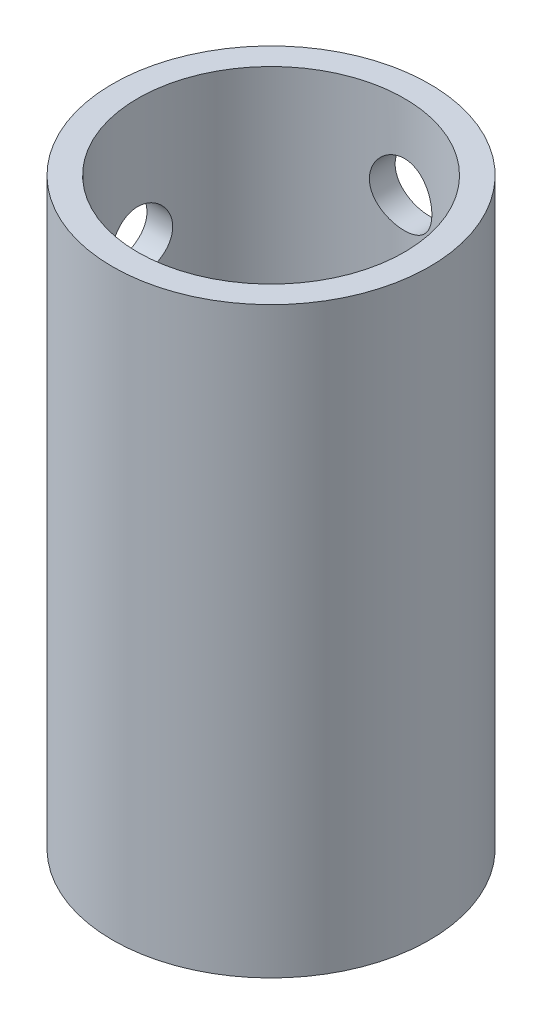
ISO-10303-21;
HEADER;
FILE_DESCRIPTION(('STEP AP214'),'2;1');
FILE_NAME('part.step','',(''),(''),'','','');
FILE_SCHEMA(('AUTOMOTIVE_DESIGN { 1 0 10303 214 1 1 1 1 }'));
ENDSEC;
DATA;
#1=APPLICATION_CONTEXT('core data for automotive mechanical design processes');
#2=APPLICATION_PROTOCOL_DEFINITION('international standard','automotive_design',2000,#1);
#3=PRODUCT_CONTEXT('',#1,'mechanical');
#4=PRODUCT('Part','Part','',(#3));
#5=PRODUCT_RELATED_PRODUCT_CATEGORY('part','',(#4));
#6=PRODUCT_DEFINITION_FORMATION('','',#4);
#7=PRODUCT_DEFINITION_CONTEXT('part definition',#1,'design');
#8=PRODUCT_DEFINITION('design','',#6,#7);
#9=PRODUCT_DEFINITION_SHAPE('','',#8);
#10=(LENGTH_UNIT() NAMED_UNIT(*) SI_UNIT(.MILLI.,.METRE.));
#11=(NAMED_UNIT(*) PLANE_ANGLE_UNIT() SI_UNIT($,.RADIAN.));
#12=(NAMED_UNIT(*) SI_UNIT($,.STERADIAN.) SOLID_ANGLE_UNIT());
#13=UNCERTAINTY_MEASURE_WITH_UNIT(LENGTH_MEASURE(1.E-05),#10,'distance_accuracy_value','');
#14=(GEOMETRIC_REPRESENTATION_CONTEXT(3) GLOBAL_UNCERTAINTY_ASSIGNED_CONTEXT((#13)) GLOBAL_UNIT_ASSIGNED_CONTEXT((#10,
#11,#12)) REPRESENTATION_CONTEXT('',''));
#15=CARTESIAN_POINT('',(0.,0.,0.));
#16=DIRECTION('',(0.,0.,1.));
#17=DIRECTION('',(1.,0.,0.));
#18=AXIS2_PLACEMENT_3D('',#15,#16,#17);
#19=CARTESIAN_POINT('',(0.,88.9,0.));
#20=DIRECTION('',(0.,1.,0.));
#21=DIRECTION('',(0.,0.,1.));
#22=AXIS2_PLACEMENT_3D('',#19,#20,#21);
#23=PLANE('',#22);
#24=CARTESIAN_POINT('',(0.,88.9,0.));
#25=DIRECTION('',(0.,1.,0.));
#26=DIRECTION('',(0.,0.,1.));
#27=AXIS2_PLACEMENT_3D('',#24,#25,#26);
#28=CIRCLE('',#27,24.1554);
#29=CARTESIAN_POINT('',(0.,88.9,24.1554));
#30=VERTEX_POINT('',#29);
#31=EDGE_CURVE('E10',#30,#30,#28,.T.);
#32=ORIENTED_EDGE('',*,*,#31,.T.);
#33=EDGE_LOOP('',(#32));
#34=FACE_BOUND('',#33,.T.);
#35=CARTESIAN_POINT('',(0.,88.9,0.));
#36=DIRECTION('',(0.,1.,0.));
#37=DIRECTION('',(0.,0.,1.));
#38=AXIS2_PLACEMENT_3D('',#35,#36,#37);
#39=CIRCLE('',#38,20.32);
#40=CARTESIAN_POINT('',(0.,88.9,20.32));
#41=VERTEX_POINT('',#40);
#42=EDGE_CURVE('E50',#41,#41,#39,.T.);
#43=ORIENTED_EDGE('',*,*,#42,.F.);
#44=EDGE_LOOP('',(#43));
#45=FACE_BOUND('',#44,.T.);
#46=ADVANCED_FACE('F31',(#34,#45),#23,.T.);
#47=CARTESIAN_POINT('',(0.,0.,0.));
#48=DIRECTION('',(0.,1.,0.));
#49=DIRECTION('',(0.,0.,1.));
#50=AXIS2_PLACEMENT_3D('',#47,#48,#49);
#51=PLANE('',#50);
#52=CARTESIAN_POINT('',(0.,0.,0.));
#53=DIRECTION('',(0.,1.,0.));
#54=DIRECTION('',(0.,0.,1.));
#55=AXIS2_PLACEMENT_3D('',#52,#53,#54);
#56=CIRCLE('',#55,24.1554);
#57=CARTESIAN_POINT('',(0.,0.,24.1554));
#58=VERTEX_POINT('',#57);
#59=EDGE_CURVE('E45',#58,#58,#56,.T.);
#60=ORIENTED_EDGE('',*,*,#59,.F.);
#61=EDGE_LOOP('',(#60));
#62=FACE_BOUND('',#61,.T.);
#63=CARTESIAN_POINT('',(0.,0.,0.));
#64=DIRECTION('',(0.,1.,0.));
#65=DIRECTION('',(0.,0.,1.));
#66=AXIS2_PLACEMENT_3D('',#63,#64,#65);
#67=CIRCLE('',#66,20.32);
#68=CARTESIAN_POINT('',(0.,0.,20.32));
#69=VERTEX_POINT('',#68);
#70=EDGE_CURVE('E53',#69,#69,#67,.T.);
#71=ORIENTED_EDGE('',*,*,#70,.T.);
#72=EDGE_LOOP('',(#71));
#73=FACE_BOUND('',#72,.T.);
#74=ADVANCED_FACE('F88',(#62,#73),#51,.F.);
#75=CARTESIAN_POINT('',(0.,88.9,0.));
#76=DIRECTION('',(0.,-1.,0.));
#77=DIRECTION('',(0.,0.,-1.));
#78=AXIS2_PLACEMENT_3D('',#75,#76,#77);
#79=CYLINDRICAL_SURFACE('',#78,24.1554);
#80=CARTESIAN_POINT('',(-23.6812572071248,69.85,-4.7625));
#81=CARTESIAN_POINT('',(-23.6812624432822,70.1147071627906,-4.7624901250679));
#82=CARTESIAN_POINT('',(-23.685743761445,70.379539558118,-4.74035580950144));
#83=CARTESIAN_POINT('',(-23.7031594442269,70.9017180638512,-4.65247387491668));
#84=CARTESIAN_POINT('',(-23.716100667004,71.1590579233658,-4.586690870736));
#85=CARTESIAN_POINT('',(-23.7489148036137,71.6586210164292,-4.41362596366756));
#86=CARTESIAN_POINT('',(-23.7687809230381,71.9008587938542,-4.30638472659384));
#87=CARTESIAN_POINT('',(-23.813198371139,72.363895513952,-4.05355804277837));
#88=CARTESIAN_POINT('',(-23.8377494142076,72.5846957622869,-3.90797493327272));
#89=CARTESIAN_POINT('',(-23.8891474457192,73.0016375950946,-3.58046382448883));
#90=CARTESIAN_POINT('',(-23.9160190079756,73.1974416187426,-3.39810987835323));
#91=CARTESIAN_POINT('',(-23.9688138709097,73.5558872533006,-3.00315381123502));
#92=CARTESIAN_POINT('',(-23.9947371060134,73.7185265745197,-2.79054960349371));
#93=CARTESIAN_POINT('',(-24.0429790900059,74.0073321507319,-2.33889691649043));
#94=CARTESIAN_POINT('',(-24.0652654899036,74.1331782064268,-2.09963993697773));
#95=CARTESIAN_POINT('',(-24.1034469108701,74.3427595030653,-1.60286493436308));
#96=CARTESIAN_POINT('',(-24.1193425131908,74.4264985738712,-1.3453485744843));
#97=CARTESIAN_POINT('',(-24.1427777365083,74.5484396601457,-0.82286675970404));
#98=CARTESIAN_POINT('',(-24.1504218269628,74.5872114700761,-0.5580390518447));
#99=CARTESIAN_POINT('',(-24.1568533822301,74.6198946349946,-0.0255348590097673));
#100=CARTESIAN_POINT('',(-24.1556416774119,74.613810195955,0.242141356523677));
#101=CARTESIAN_POINT('',(-24.1445792795746,74.5573868679244,0.768830664213412));
#102=CARTESIAN_POINT('',(-24.1348483935526,74.5076616838684,1.02791238342972));
#103=CARTESIAN_POINT('',(-24.1079759403617,74.366341153616,1.53398084981905));
#104=CARTESIAN_POINT('',(-24.0908340826555,74.2747441658844,1.78096712238384));
#105=CARTESIAN_POINT('',(-24.050867651333,74.0517078275796,2.25759124510069));
#106=CARTESIAN_POINT('',(-24.0280087767227,73.920026906381,2.48711305843599));
#107=CARTESIAN_POINT('',(-23.9791301200994,73.6207392161528,2.92103002541779));
#108=CARTESIAN_POINT('',(-23.9531099842908,73.4531284243889,3.12542236151445));
#109=CARTESIAN_POINT('',(-23.90026456997,73.083368589885,3.50691909643202));
#110=CARTESIAN_POINT('',(-23.8734331193731,72.8806824916468,3.68350249466342));
#111=CARTESIAN_POINT('',(-23.822408068296,72.4483045323699,4.00025505509381));
#112=CARTESIAN_POINT('',(-23.7982145149447,72.2186121889874,4.14042356676284));
#113=CARTESIAN_POINT('',(-23.7551931300784,71.7380069976139,4.38053989691627));
#114=CARTESIAN_POINT('',(-23.7363763049166,71.4870519656708,4.48040538347757));
#115=CARTESIAN_POINT('',(-23.7064019240234,70.9714683426218,4.63640275940167));
#116=CARTESIAN_POINT('',(-23.6952434006637,70.7068414834991,4.69254017393696));
#117=CARTESIAN_POINT('',(-23.6820423235531,70.176142468483,4.75871338927884));
#118=CARTESIAN_POINT('',(-23.6798511923951,69.9101676082023,4.76950066250853));
#119=CARTESIAN_POINT('',(-23.6844344583095,69.3802184738129,4.7466877256515));
#120=CARTESIAN_POINT('',(-23.6912083622169,69.1162440904617,4.71308995717796));
#121=CARTESIAN_POINT('',(-23.7128194816892,68.6003021706195,4.60310787451524));
#122=CARTESIAN_POINT('',(-23.7275813226517,68.3482459751415,4.52712332049563));
#123=CARTESIAN_POINT('',(-23.7634392043961,67.8604420959814,4.33495126831185));
#124=CARTESIAN_POINT('',(-23.7845357543538,67.6246957251367,4.2187605383129));
#125=CARTESIAN_POINT('',(-23.8310208544897,67.1729100252135,3.94776667286771));
#126=CARTESIAN_POINT('',(-23.8564604706919,66.9571587274486,3.79249227733631));
#127=CARTESIAN_POINT('',(-23.9086243722687,66.5545007515152,3.44836862440196));
#128=CARTESIAN_POINT('',(-23.9353487857656,66.3675969579268,3.25951601343347));
#129=CARTESIAN_POINT('',(-23.987552219003,66.0251000217249,2.85022725050358));
#130=CARTESIAN_POINT('',(-24.0130067797525,65.8700143520065,2.62936281832281));
#131=CARTESIAN_POINT('',(-24.059380365509,65.599151293086,2.16427784644934));
#132=CARTESIAN_POINT('',(-24.0802995774624,65.4833722835576,1.92005827005059));
#133=CARTESIAN_POINT('',(-24.1151408253291,65.2951534155386,1.41654534745723));
#134=CARTESIAN_POINT('',(-24.1291017186042,65.222472442063,1.1573449407141));
#135=CARTESIAN_POINT('',(-24.1486197697839,65.1217475019746,0.630112624889908));
#136=CARTESIAN_POINT('',(-24.1541779099738,65.0936983178667,0.362081751837708));
#137=CARTESIAN_POINT('',(-24.1562418355085,65.0832305002557,-0.170351375162292));
#138=CARTESIAN_POINT('',(-24.1528991418724,65.1000480981373,-0.434738324648256));
#139=CARTESIAN_POINT('',(-24.1378546988503,65.177153227216,-0.956839965327164));
#140=CARTESIAN_POINT('',(-24.1261530485502,65.2374402431317,-1.21455473557383));
#141=CARTESIAN_POINT('',(-24.0957087713493,65.3994374489598,-1.71553729433952));
#142=CARTESIAN_POINT('',(-24.0769813383013,65.5010582906004,-1.9588349557095));
#143=CARTESIAN_POINT('',(-24.0345044592979,65.7427431554663,-2.42503673706688));
#144=CARTESIAN_POINT('',(-24.0107546302759,65.8828101112839,-2.64793929962707));
#145=CARTESIAN_POINT('',(-23.9603757703728,66.1999998399749,-3.07080686849756));
#146=CARTESIAN_POINT('',(-23.933707362322,66.3776702895912,-3.27035642179728));
#147=CARTESIAN_POINT('',(-23.8807342707579,66.7638956745041,-3.63707204322628));
#148=CARTESIAN_POINT('',(-23.8544296747153,66.9724579006221,-3.80423044510831));
#149=CARTESIAN_POINT('',(-23.8048614498442,67.4171501267863,-4.10306808358924));
#150=CARTESIAN_POINT('',(-23.7816323347244,67.6535445489749,-4.23435979512627));
#151=CARTESIAN_POINT('',(-23.7412652004059,68.1454275236267,-4.4551514859022));
#152=CARTESIAN_POINT('',(-23.7241216068256,68.4008983409358,-4.54468973532421));
#153=CARTESIAN_POINT('',(-23.7013242902654,68.8558242344841,-4.66187558902265));
#154=CARTESIAN_POINT('',(-23.693845316479,69.0526681315923,-4.69954289284168));
#155=CARTESIAN_POINT('',(-23.6838098751832,69.4496508775573,-4.74985842387384));
#156=CARTESIAN_POINT('',(-23.6812532467746,69.6497896184981,-4.76250746887202));
#157=CARTESIAN_POINT('',(-23.6812572071248,69.85,-4.7625));
#158=B_SPLINE_CURVE_WITH_KNOTS('',3,(#80,#81,#82,#83,#84,#85,#86,#87,#88,#89,#90,#91,#92,#93,
#94,#95,#96,#97,#98,#99,#100,#101,#102,#103,#104,#105,#106,#107,#108,#109,#110,#111,#112,#113,
#114,#115,#116,#117,#118,#119,#120,#121,#122,#123,#124,#125,#126,#127,#128,#129,#130,#131,#132,
#133,#134,#135,#136,#137,#138,#139,#140,#141,#142,#143,#144,#145,#146,#147,#148,#149,#150,#151,
#152,#153,#154,#155,#156,#157),.UNSPECIFIED.,.T.,.F.,(4,2,2,2,2,2,2,2,2,2,2,2,2,2,2,2,2,2,2,2,2,
2,2,2,2,2,2,2,2,2,2,2,2,2,2,2,2,2,4),(0.,0.793388516325587,1.58742100475954,2.38067660570947,
3.1738838627329,3.97687008676941,4.77991173021484,5.58974704048092,6.39950867843342,
7.19889342475629,7.99820321725651,8.78644952041961,9.5747267285114,10.3678519334846,
11.1610659837534,11.9677191613308,12.7743867482896,13.5826939725545,14.3908990482137,
15.1856576846343,15.9803726033453,16.767716089197,17.5551228776464,18.3525214069971,
19.1499996199112,19.9593483576205,20.768663727745,21.5734075301297,22.3780572503518,
23.1690971632356,23.9601276993785,24.7494573344406,25.53884719472,26.3406407618669,
27.1426238641142,27.9529570990115,28.7625461356595,29.3626425151898,29.962719278728),.UNSPECIFIED.);
#159=CARTESIAN_POINT('',(-23.6812572071248,69.85,-4.7625));
#160=VERTEX_POINT('',#159);
#161=EDGE_CURVE('E62',#160,#160,#158,.T.);
#162=ORIENTED_EDGE('',*,*,#161,.T.);
#163=EDGE_LOOP('',(#162));
#164=FACE_BOUND('',#163,.T.);
#165=CARTESIAN_POINT('',(0.,80.9625,-24.1554));
#166=CARTESIAN_POINT('',(-0.264763542173837,80.9624901687644,-24.1553951347501));
#167=CARTESIAN_POINT('',(-0.52965219881599,80.940346742801,-24.1510022129458));
#168=CARTESIAN_POINT('',(-1.05194752569415,80.852425343044,-24.1339016309654));
#169=CARTESIAN_POINT('',(-1.30934799103893,80.7866122013515,-24.1211872695177));
#170=CARTESIAN_POINT('',(-1.80903943353851,80.6134591848702,-24.0888641359616));
#171=CARTESIAN_POINT('',(-2.05134444102881,80.5061585595912,-24.0692618817838));
#172=CARTESIAN_POINT('',(-2.5144944909007,80.2531918843976,-24.0252961417605));
#173=CARTESIAN_POINT('',(-2.73534091613329,80.1075283089463,-24.0009329630274));
#174=CARTESIAN_POINT('',(-3.1522334468627,79.7799347259105,-23.9497695589749));
#175=CARTESIAN_POINT('',(-3.34795595993617,79.597596840065,-23.9229439565521));
#176=CARTESIAN_POINT('',(-3.7062434667598,79.20270748469,-23.870064602647));
#177=CARTESIAN_POINT('',(-3.86880592047441,78.9901537027601,-23.8440109104231));
#178=CARTESIAN_POINT('',(-4.15752880267533,78.5385480065779,-23.7953777356228));
#179=CARTESIAN_POINT('',(-4.28335553447681,78.2992789227312,-23.7728309208219));
#180=CARTESIAN_POINT('',(-4.4928978031172,77.8024777356457,-23.7341240867229));
#181=CARTESIAN_POINT('',(-4.57661737624298,77.5449473855874,-23.7179634552929));
#182=CARTESIAN_POINT('',(-4.69852110455442,77.0224111546494,-23.69411520027));
#183=CARTESIAN_POINT('',(-4.73727221880451,76.7575424490249,-23.686322174398));
#184=CARTESIAN_POINT('',(-4.76989977129345,76.2249571247673,-23.6797741117301));
#185=CARTESIAN_POINT('',(-4.76378066614101,75.9572407916042,-23.6810181773504));
#186=CARTESIAN_POINT('',(-4.70730018195985,75.4306982529004,-23.6923079195356));
#187=CARTESIAN_POINT('',(-4.65758751970927,75.1717992825771,-23.7022245338856));
#188=CARTESIAN_POINT('',(-4.51635451080862,74.6660897476093,-23.7295389203918));
#189=CARTESIAN_POINT('',(-4.42483221846068,74.419279746142,-23.7469370407133));
#190=CARTESIAN_POINT('',(-4.20195502368091,73.942878015266,-23.7873867495646));
#191=CARTESIAN_POINT('',(-4.07034187677795,73.7134103255514,-23.8104747998733));
#192=CARTESIAN_POINT('',(-3.77120129689521,73.2795733383295,-23.8596793567626));
#193=CARTESIAN_POINT('',(-3.6036698482519,73.0752068511565,-23.8857962018122));
#194=CARTESIAN_POINT('',(-3.23396930630152,72.6936291004594,-23.9386755160817));
#195=CARTESIAN_POINT('',(-3.03124626064001,72.5169545679815,-23.9654412938101));
#196=CARTESIAN_POINT('',(-2.59876090172113,72.200035321926,-24.016184522859));
#197=CARTESIAN_POINT('',(-2.36899826021206,72.059791050666,-24.0401619403228));
#198=CARTESIAN_POINT('',(-1.88836807713478,71.8196187706016,-24.0826832417972));
#199=CARTESIAN_POINT('',(-1.63746975678765,71.7197508303868,-24.1012190190453));
#200=CARTESIAN_POINT('',(-1.12201024451363,71.5637314612385,-24.1307067852562));
#201=CARTESIAN_POINT('',(-0.857450664074372,71.5075748885994,-24.1416596665143));
#202=CARTESIAN_POINT('',(-0.326792081401532,71.441329239632,-24.1546236768324));
#203=CARTESIAN_POINT('',(-0.0607881749667143,71.4305054360856,-24.1567774032744));
#204=CARTESIAN_POINT('',(0.469227580389069,71.4532556927609,-24.1522960083829));
#205=CARTESIAN_POINT('',(0.733239537205333,71.4868273306567,-24.1456613665648));
#206=CARTESIAN_POINT('',(1.24941604115357,71.5968049782274,-24.1244378427394));
#207=CARTESIAN_POINT('',(1.50166377406096,71.6728352106581,-24.1099187720699));
#208=CARTESIAN_POINT('',(1.98983071051704,71.865162122553,-24.0745482575083));
#209=CARTESIAN_POINT('',(2.22574871513438,71.9814617548486,-24.0536963492624));
#210=CARTESIAN_POINT('',(2.67766658386679,72.2526241362356,-24.0076178627108));
#211=CARTESIAN_POINT('',(2.89339497970789,72.4079307661525,-23.982342021693));
#212=CARTESIAN_POINT('',(3.2959919345318,72.7521027540416,-23.9303377854538));
#213=CARTESIAN_POINT('',(3.48285748889903,72.9409716014382,-23.9036092393971));
#214=CARTESIAN_POINT('',(3.82524984108531,73.3502472415945,-23.8512331593297));
#215=CARTESIAN_POINT('',(3.98027292433527,73.5710787009541,-23.8256074266273));
#216=CARTESIAN_POINT('',(4.25102629515299,74.036078910645,-23.7787947842749));
#217=CARTESIAN_POINT('',(4.36675813095151,74.280246740945,-23.7576076997371));
#218=CARTESIAN_POINT('',(4.55494991770783,74.7837747629212,-23.7222461514111));
#219=CARTESIAN_POINT('',(4.62763080972161,75.043049749496,-23.7080359472077));
#220=CARTESIAN_POINT('',(4.72833040035522,75.5704411292129,-23.6881599598845));
#221=CARTESIAN_POINT('',(4.75635473847747,75.8385564015841,-23.6824930978641));
#222=CARTESIAN_POINT('',(4.76674161379691,76.3709629751712,-23.6804041207086));
#223=CARTESIAN_POINT('',(4.74989976929061,76.6352384449807,-23.6838209215046));
#224=CARTESIAN_POINT('',(4.67278503905074,77.1571106501505,-23.6991550067161));
#225=CARTESIAN_POINT('',(4.61251248058547,77.4147074358224,-23.7110722270773));
#226=CARTESIAN_POINT('',(4.45059774045942,77.9154219859655,-23.7419933226827));
#227=CARTESIAN_POINT('',(4.34905047727914,78.1585715137271,-23.7609809299754));
#228=CARTESIAN_POINT('',(4.10755916671771,78.6245071225177,-23.8039131626329));
#229=CARTESIAN_POINT('',(3.96761201601998,78.847291555785,-23.827858188597));
#230=CARTESIAN_POINT('',(3.65056478268792,79.2701402085515,-23.8785018010624));
#231=CARTESIAN_POINT('',(3.47288907850723,79.4697682454092,-23.9052393444416));
#232=CARTESIAN_POINT('',(3.086619536146,79.836639774433,-23.9581730217806));
#233=CARTESIAN_POINT('',(2.8780186043848,80.0038758162201,-23.9843690299491));
#234=CARTESIAN_POINT('',(2.43328506128356,80.3028103328005,-24.0335802606447));
#235=CARTESIAN_POINT('',(2.19689521589035,80.434132078116,-24.0565606144032));
#236=CARTESIAN_POINT('',(1.70501928374088,80.6549811349237,-24.0964087679017));
#237=CARTESIAN_POINT('',(1.44955082549667,80.7445464880255,-24.1132821281896));
#238=CARTESIAN_POINT('',(0.9945553308215,80.861798230949,-24.1356993063735));
#239=CARTESIAN_POINT('',(0.797635219871518,80.8994947207419,-24.1430441857016));
#240=CARTESIAN_POINT('',(0.400500538179269,80.9498489445849,-24.152896299461));
#241=CARTESIAN_POINT('',(0.200286067410158,80.9625074370493,-24.1554036804228));
#242=CARTESIAN_POINT('',(0.,80.9625,-24.1554));
#243=B_SPLINE_CURVE_WITH_KNOTS('',3,(#165,#166,#167,#168,#169,#170,#171,#172,#173,#174,#175,
#176,#177,#178,#179,#180,#181,#182,#183,#184,#185,#186,#187,#188,#189,#190,#191,#192,#193,#194,
#195,#196,#197,#198,#199,#200,#201,#202,#203,#204,#205,#206,#207,#208,#209,#210,#211,#212,#213,
#214,#215,#216,#217,#218,#219,#220,#221,#222,#223,#224,#225,#226,#227,#228,#229,#230,#231,#232,
#233,#234,#235,#236,#237,#238,#239,#240,#241,#242),.UNSPECIFIED.,.T.,.F.,(4,2,2,2,2,2,2,2,2,2,2,
2,2,2,2,2,2,2,2,2,2,2,2,2,2,2,2,2,2,2,2,2,2,2,2,2,2,2,4),(0.,0.793557978124505,1.58775579765687,
2.38120409227143,3.17460122090118,3.97736566951724,4.78019158621282,5.59009811467836,
6.399926992727,7.19943069907904,7.9988549980434,8.78658115328042,9.57434397072324,
10.3672924798558,11.1603296868453,11.9672202468803,12.7741206033095,13.5822170211481,
14.3902183324052,15.185072103078,15.9798825063353,16.7677674935933,17.5557102662734,
18.3530614566904,19.1504955953335,19.9597094776735,20.76889147008,21.5738838604384,
22.3787745833816,23.1694874932378,23.9601944448096,24.7490932222765,25.538055773995,
26.3400531547543,27.142234781876,27.9525337022581,28.7620929609552,29.3624151199287,
29.9627190945453),.UNSPECIFIED.);
#244=CARTESIAN_POINT('',(0.,80.9625,-24.1554));
#245=VERTEX_POINT('',#244);
#246=EDGE_CURVE('E61',#245,#245,#243,.T.);
#247=ORIENTED_EDGE('',*,*,#246,.T.);
#248=EDGE_LOOP('',(#247));
#249=FACE_BOUND('',#248,.T.);
#250=ORIENTED_EDGE('',*,*,#31,.F.);
#251=EDGE_LOOP('',(#250));
#252=FACE_BOUND('',#251,.T.);
#253=ORIENTED_EDGE('',*,*,#59,.T.);
#254=EDGE_LOOP('',(#253));
#255=FACE_BOUND('',#254,.T.);
#256=ADVANCED_FACE('F33',(#164,#249,#252,#255),#79,.T.);
#257=CARTESIAN_POINT('',(0.,88.9,0.));
#258=DIRECTION('',(0.,-1.,0.));
#259=DIRECTION('',(0.,0.,-1.));
#260=AXIS2_PLACEMENT_3D('',#257,#258,#259);
#261=CYLINDRICAL_SURFACE('',#260,20.32);
#262=CARTESIAN_POINT('',(-19.7540120924839,69.85,-4.7625));
#263=CARTESIAN_POINT('',(-19.7540173514219,70.1135391583576,-4.76249164713757));
#264=CARTESIAN_POINT('',(-19.7593434432666,70.3771746995928,-4.74055060994133));
#265=CARTESIAN_POINT('',(-19.7800258826579,70.8969129368943,-4.65348330600756));
#266=CARTESIAN_POINT('',(-19.7953887917612,71.1530105905376,-4.58832878808747));
#267=CARTESIAN_POINT('',(-19.8343115230671,71.6500801282435,-4.41702812308156));
#268=CARTESIAN_POINT('',(-19.8578615827076,71.8910696254746,-4.31093078073417));
#269=CARTESIAN_POINT('',(-19.9104931892119,72.3518442254637,-4.06090048509455));
#270=CARTESIAN_POINT('',(-19.9395747933912,72.5716291084731,-3.91696713975595));
#271=CARTESIAN_POINT('',(-20.0006225730661,72.9880130016659,-3.59237637042963));
#272=CARTESIAN_POINT('',(-20.0326301878775,73.1841411701884,-3.4111226349007));
#273=CARTESIAN_POINT('',(-20.095562387331,73.5435088171937,-3.01832218220031));
#274=CARTESIAN_POINT('',(-20.126486879614,73.7067454965909,-2.80677288947715));
#275=CARTESIAN_POINT('',(-20.184223338583,73.997590067381,-2.35619595188712));
#276=CARTESIAN_POINT('',(-20.2109806985805,74.1247403663517,-2.1168653331023));
#277=CARTESIAN_POINT('',(-20.2568977033374,74.3368352521855,-1.61949890063755));
#278=CARTESIAN_POINT('',(-20.2760583297624,74.421785292612,-1.36146550886888));
#279=CARTESIAN_POINT('',(-20.3043300933233,74.5455740885188,-0.83892051199974));
#280=CARTESIAN_POINT('',(-20.3136149927318,74.5852110892385,-0.574607569699432));
#281=CARTESIAN_POINT('',(-20.3216928738208,74.6197492159841,-0.0429315797710147));
#282=CARTESIAN_POINT('',(-20.3204872259362,74.6146561853259,0.224431064901445));
#283=CARTESIAN_POINT('',(-20.3078509856042,74.5604634654217,0.749098019815182));
#284=CARTESIAN_POINT('',(-20.2966204496921,74.5122247535571,1.00649679521888));
#285=CARTESIAN_POINT('',(-20.2654266091964,74.3744877485673,1.50944008882897));
#286=CARTESIAN_POINT('',(-20.2454628736018,74.2849874190399,1.75498402129736));
#287=CARTESIAN_POINT('',(-20.1987316039252,74.0665379895639,2.22957841171315));
#288=CARTESIAN_POINT('',(-20.1719097638709,73.9372722652212,2.45847756514933));
#289=CARTESIAN_POINT('',(-20.1143882630683,73.643199401287,2.89164311763799));
#290=CARTESIAN_POINT('',(-20.0836880023379,73.4783867598789,3.0959056958957));
#291=CARTESIAN_POINT('',(-20.0209071432427,73.1132452198691,3.47912830128302));
#292=CARTESIAN_POINT('',(-19.9888110863201,72.9121631739547,3.65736888412752));
#293=CARTESIAN_POINT('',(-19.9275341011303,72.4826272604266,3.97774649866238));
#294=CARTESIAN_POINT('',(-19.8983532775076,72.2541724108934,4.11988223462571));
#295=CARTESIAN_POINT('',(-19.8461622896702,71.7750934369047,4.36440224547437));
#296=CARTESIAN_POINT('',(-19.8231761138401,71.5243879894004,4.46663265541371));
#297=CARTESIAN_POINT('',(-19.7862959741439,71.0086852760441,4.62728404113041));
#298=CARTESIAN_POINT('',(-19.7724003281834,70.7436906640607,4.68571312211488));
#299=CARTESIAN_POINT('',(-19.7556226234519,70.2135534569267,4.75594995605509));
#300=CARTESIAN_POINT('',(-19.7524912939381,69.9485584114714,4.7688131037547));
#301=CARTESIAN_POINT('',(-19.7569213762032,69.4202097346848,4.75042586061012));
#302=CARTESIAN_POINT('',(-19.7644819343552,69.1568559740014,4.7191789914544));
#303=CARTESIAN_POINT('',(-19.7892068027707,68.6430575611209,4.6143792503335));
#304=CARTESIAN_POINT('',(-19.8062354444263,68.3924839488253,4.54142361750285));
#305=CARTESIAN_POINT('',(-19.8478522842961,67.9071192320565,4.35593140950215));
#306=CARTESIAN_POINT('',(-19.8724412918113,67.6723298204873,4.24339059674171));
#307=CARTESIAN_POINT('',(-19.9269448662728,67.2206772442817,3.97965412663702));
#308=CARTESIAN_POINT('',(-19.9569449558736,67.0041988489719,3.8278175966443));
#309=CARTESIAN_POINT('',(-20.0186726748586,66.5994063177104,3.49062452184264));
#310=CARTESIAN_POINT('',(-20.0504005517986,66.4110962322464,3.30526316475027));
#311=CARTESIAN_POINT('',(-20.1128418541569,66.0638029505823,2.90147310563081));
#312=CARTESIAN_POINT('',(-20.1435183473688,65.9055444804249,2.68241435445607));
#313=CARTESIAN_POINT('',(-20.1996825103016,65.6280682878547,2.22021193999274));
#314=CARTESIAN_POINT('',(-20.2251704389178,65.5088486173315,1.97706947931603));
#315=CARTESIAN_POINT('',(-20.2679319678358,65.3138000148804,1.47521402110231));
#316=CARTESIAN_POINT('',(-20.2852613768816,65.2376755398509,1.21662086335579));
#317=CARTESIAN_POINT('',(-20.3099961749922,65.1300706765654,0.689858700652902));
#318=CARTESIAN_POINT('',(-20.3174032336036,65.0985827776529,0.421691314465783));
#319=CARTESIAN_POINT('',(-20.3214001470995,65.0815240527821,-0.109762785763345));
#320=CARTESIAN_POINT('',(-20.3182434348765,65.094877476291,-0.373013624054597));
#321=CARTESIAN_POINT('',(-20.3020196892177,65.1646881444691,-0.893408000610421));
#322=CARTESIAN_POINT('',(-20.2889528877956,65.2211443800206,-1.15055168170968));
#323=CARTESIAN_POINT('',(-20.2544060204226,65.3750115398043,-1.65045689399354));
#324=CARTESIAN_POINT('',(-20.2329615423417,65.4722493531675,-1.89327432525313));
#325=CARTESIAN_POINT('',(-20.1839332092314,65.7047578430881,-2.35928004498965));
#326=CARTESIAN_POINT('',(-20.1563486675235,65.8400327740001,-2.58246613408308));
#327=CARTESIAN_POINT('',(-20.0972937948007,66.148173376785,-3.00805188134049));
#328=CARTESIAN_POINT('',(-20.0657528208262,66.3217829473503,-3.20990315625607));
#329=CARTESIAN_POINT('',(-20.0026886973913,66.7001910971465,-3.58197392914204));
#330=CARTESIAN_POINT('',(-19.9711655542374,66.9049973503376,-3.75218562126823));
#331=CARTESIAN_POINT('',(-19.9111430412671,67.3438950954286,-4.05877265846514));
#332=CARTESIAN_POINT('',(-19.8826995632979,67.5783995653863,-4.19456849062254));
#333=CARTESIAN_POINT('',(-19.8327816485727,68.0675317106353,-4.4246050158074));
#334=CARTESIAN_POINT('',(-19.8113017114102,68.3221433049005,-4.51887852796538));
#335=CARTESIAN_POINT('',(-19.7814206132206,68.7889091547563,-4.6477028208354));
#336=CARTESIAN_POINT('',(-19.7712149407359,68.9986668975253,-4.69066389847031));
#337=CARTESIAN_POINT('',(-19.7575087629289,69.422262105252,-4.74806495582272));
#338=CARTESIAN_POINT('',(-19.7540078240841,69.6360993055324,-4.76250677957342));
#339=CARTESIAN_POINT('',(-19.7540120924839,69.85,-4.7625));
#340=B_SPLINE_CURVE_WITH_KNOTS('',3,(#262,#263,#264,#265,#266,#267,#268,#269,#270,#271,#272,
#273,#274,#275,#276,#277,#278,#279,#280,#281,#282,#283,#284,#285,#286,#287,#288,#289,#290,#291,
#292,#293,#294,#295,#296,#297,#298,#299,#300,#301,#302,#303,#304,#305,#306,#307,#308,#309,#310,
#311,#312,#313,#314,#315,#316,#317,#318,#319,#320,#321,#322,#323,#324,#325,#326,#327,#328,#329,
#330,#331,#332,#333,#334,#335,#336,#337,#338,#339),.UNSPECIFIED.,.T.,.F.,(4,2,2,2,2,2,2,2,2,2,2,
2,2,2,2,2,2,2,2,2,2,2,2,2,2,2,2,2,2,2,2,2,2,2,2,2,2,2,4),(0.,0.789832809032319,1.58018248766305,
2.36959294798609,3.15901158828832,3.9621882644473,4.76543326258504,5.57844996477896,
6.39136157301198,7.18972070298145,7.98797554071177,8.77064795994942,9.5533590108917,
10.342471033728,11.1317052800793,11.9397580178506,12.7478397508396,13.5590071739823,
14.3700244577539,15.1621295497892,15.9541714047232,16.735146121721,17.5162044674573,
18.310906104567,19.1057219068931,19.91777798863,20.7297935410438,21.5361707204669,
22.3424122008362,23.1294513352792,23.9164720442238,24.7001852660441,25.4839861790818,
26.2845951250842,27.0854013290044,27.8989094106097,28.7117733386444,29.3528800052514,
29.9939452170331),.UNSPECIFIED.);
#341=CARTESIAN_POINT('',(-19.7540120924839,69.85,-4.7625));
#342=VERTEX_POINT('',#341);
#343=EDGE_CURVE('E36',#342,#342,#340,.T.);
#344=ORIENTED_EDGE('',*,*,#343,.F.);
#345=EDGE_LOOP('',(#344));
#346=FACE_BOUND('',#345,.T.);
#347=CARTESIAN_POINT('',(0.,80.9625,-20.32));
#348=CARTESIAN_POINT('',(-0.263651292727227,80.9624917212222,-20.3199952667281));
#349=CARTESIAN_POINT('',(-0.527398797454744,80.9405326461058,-20.3148170448938));
#350=CARTESIAN_POINT('',(-1.04736938231726,80.8533872107734,-20.2946609788806));
#351=CARTESIAN_POINT('',(-1.30358751516344,80.7881730642853,-20.2796768356386));
#352=CARTESIAN_POINT('',(-1.80091244243285,80.6166981236206,-20.2415728985206));
#353=CARTESIAN_POINT('',(-2.0420358269804,80.5104833461633,-20.2184622279661));
#354=CARTESIAN_POINT('',(-2.50303686299764,80.2601760808524,-20.1665834479557));
#355=CARTESIAN_POINT('',(-2.72291444005248,80.1160834603356,-20.1378153186853));
#356=CARTESIAN_POINT('',(-3.13920249881133,79.7913280956113,-20.0771719198233));
#357=CARTESIAN_POINT('',(-3.33516948027986,79.6101048739491,-20.0452534657663));
#358=CARTESIAN_POINT('',(-3.6942235207218,79.2174342382912,-19.9822025372912));
#359=CARTESIAN_POINT('',(-3.85730728673229,79.0059838009272,-19.9510701418627));
#360=CARTESIAN_POINT('',(-4.14798462605175,78.5555021953721,-19.8926860433013));
#361=CARTESIAN_POINT('',(-4.27509445190666,78.3161511005661,-19.8654894385186));
#362=CARTESIAN_POINT('',(-4.48710897060116,77.8187406234185,-19.8186810993199));
#363=CARTESIAN_POINT('',(-4.57201952285716,77.5606838440871,-19.7990683119663));
#364=CARTESIAN_POINT('',(-4.69573647075422,77.0380310137353,-19.7700901160464));
#365=CARTESIAN_POINT('',(-4.73533413087792,76.77363221779,-19.7605490693872));
#366=CARTESIAN_POINT('',(-4.7697637704463,76.2417854387845,-19.7522680141775));
#367=CARTESIAN_POINT('',(-4.76460210461393,75.9743378939562,-19.7535264723627));
#368=CARTESIAN_POINT('',(-4.71029372377973,75.4499547975682,-19.7665437615056));
#369=CARTESIAN_POINT('',(-4.66207750706432,75.1929165153009,-19.7780804466905));
#370=CARTESIAN_POINT('',(-4.52450781313109,74.6906822534805,-19.8100017281842));
#371=CARTESIAN_POINT('',(-4.43515172402554,74.4454870269113,-19.8303868862602));
#372=CARTESIAN_POINT('',(-4.21701444345326,73.9713419672848,-19.8779198068114));
#373=CARTESIAN_POINT('',(-4.0878852593373,73.7425584246294,-19.90512684995));
#374=CARTESIAN_POINT('',(-3.79411130752849,73.3095676869164,-19.9632030640004));
#375=CARTESIAN_POINT('',(-3.62946102637035,73.1053643147846,-19.9940728030883));
#376=CARTESIAN_POINT('',(-3.26444424538909,72.7219850008777,-20.056940755651));
#377=CARTESIAN_POINT('',(-3.06328934236725,72.543560327296,-20.0889479113839));
#378=CARTESIAN_POINT('',(-2.63353899873264,72.222844723267,-20.1497864979355));
#379=CARTESIAN_POINT('',(-2.40494290766947,72.0805546495829,-20.1786178534457));
#380=CARTESIAN_POINT('',(-1.92580735110144,71.8359185105775,-20.2299728448117));
#381=CARTESIAN_POINT('',(-1.67520982051125,71.7336822840726,-20.2524790883918));
#382=CARTESIAN_POINT('',(-1.15974417358305,71.5729871456141,-20.2885203552983));
#383=CARTESIAN_POINT('',(-0.894878455911697,71.5145208998284,-20.3020568814922));
#384=CARTESIAN_POINT('',(-0.364828884305247,71.4441444706803,-20.31841547103));
#385=CARTESIAN_POINT('',(-0.0997881627937772,71.4312096281473,-20.321473308961));
#386=CARTESIAN_POINT('',(0.428668274860055,71.4494698670307,-20.317195934432));
#387=CARTESIAN_POINT('',(0.692084116902738,71.4806614851457,-20.3098615376149));
#388=CARTESIAN_POINT('',(1.20633803798082,71.5854417257426,-20.2857737301458));
#389=CARTESIAN_POINT('',(1.45729396979544,71.658482441627,-20.269142110005));
#390=CARTESIAN_POINT('',(1.94338618269397,71.844270821108,-20.2283266321482));
#391=CARTESIAN_POINT('',(2.17852098427535,71.9570221920908,-20.2041420693135));
#392=CARTESIAN_POINT('',(2.63045609973071,72.2210934872324,-20.1503292349868));
#393=CARTESIAN_POINT('',(2.84690274985798,72.3730018026505,-20.1206200341985));
#394=CARTESIAN_POINT('',(3.25159852001279,72.7103112922422,-20.0591993070781));
#395=CARTESIAN_POINT('',(3.43984338789463,72.8957175078098,-20.0274874798211));
#396=CARTESIAN_POINT('',(3.7869274045113,73.2994907976688,-19.9648042863817));
#397=CARTESIAN_POINT('',(3.94505222342494,73.5184775497194,-19.933863223814));
#398=CARTESIAN_POINT('',(4.22229384154949,73.9804936545997,-19.8769903000355));
#399=CARTESIAN_POINT('',(4.34141238276215,74.223521933115,-19.8510582151474));
#400=CARTESIAN_POINT('',(4.5364057593329,74.7253952267466,-19.8074080257938));
#401=CARTESIAN_POINT('',(4.61253367520691,74.9841375295628,-19.7896419666665));
#402=CARTESIAN_POINT('',(4.72009516590419,75.5112197414719,-19.7642660436988));
#403=CARTESIAN_POINT('',(4.75153713150095,75.7795578390389,-19.7566542731831));
#404=CARTESIAN_POINT('',(4.76843682129726,76.310981303975,-19.7525813151799));
#405=CARTESIAN_POINT('',(4.75503126815787,76.5740290278032,-19.7558444792606));
#406=CARTESIAN_POINT('',(4.68518693601304,77.0940030134542,-19.7725235652008));
#407=CARTESIAN_POINT('',(4.62874882828514,77.3509293707016,-19.7859393286868));
#408=CARTESIAN_POINT('',(4.47502639019924,77.8503030462815,-19.8212680643719));
#409=CARTESIAN_POINT('',(4.37793072356401,78.0928114076738,-19.8431417537148));
#410=CARTESIAN_POINT('',(4.14580358740314,78.5582565053477,-19.8929319508117));
#411=CARTESIAN_POINT('',(4.01076751075084,78.7811908604281,-19.9208491923434));
#412=CARTESIAN_POINT('',(3.70292298049803,79.2067103400973,-19.9803862354539));
#413=CARTESIAN_POINT('',(3.52931461228961,79.4087069920281,-20.012076625578));
#414=CARTESIAN_POINT('',(3.15084500934754,79.7810715341009,-20.0751416290763));
#415=CARTESIAN_POINT('',(2.94597648270189,79.9514320240128,-20.1065161669481));
#416=CARTESIAN_POINT('',(2.50699916250122,80.2582221531989,-20.1659889241388));
#417=CARTESIAN_POINT('',(2.27248897912007,80.394089407578,-20.1940293072384));
#418=CARTESIAN_POINT('',(1.78333564457197,80.6242579845694,-20.2430809628184));
#419=CARTESIAN_POINT('',(1.52870838864606,80.7185917444932,-20.2640977175914));
#420=CARTESIAN_POINT('',(1.06179279424662,80.8475498085301,-20.2932921538133));
#421=CARTESIAN_POINT('',(0.851893339689692,80.8905687292743,-20.3032423458092));
#422=CARTESIAN_POINT('',(0.428016902267233,80.9480463583974,-20.3165980006768));
#423=CARTESIAN_POINT('',(0.214040156294181,80.9625067209641,-20.3200038426144));
#424=CARTESIAN_POINT('',(0.,80.9625,-20.32));
#425=B_SPLINE_CURVE_WITH_KNOTS('',3,(#347,#348,#349,#350,#351,#352,#353,#354,#355,#356,#357,
#358,#359,#360,#361,#362,#363,#364,#365,#366,#367,#368,#369,#370,#371,#372,#373,#374,#375,#376,
#377,#378,#379,#380,#381,#382,#383,#384,#385,#386,#387,#388,#389,#390,#391,#392,#393,#394,#395,
#396,#397,#398,#399,#400,#401,#402,#403,#404,#405,#406,#407,#408,#409,#410,#411,#412,#413,#414,
#415,#416,#417,#418,#419,#420,#421,#422,#423,#424),.UNSPECIFIED.,.T.,.F.,(4,2,2,2,2,2,2,2,2,2,2,
2,2,2,2,2,2,2,2,2,2,2,2,2,2,2,2,2,2,2,2,2,2,2,2,2,2,2,4),(0.,0.790169975569843,1.58084803421899,
2.37064124999183,3.16043723196758,3.96317303580944,4.76598918665549,5.57913709557229,
6.39217206642453,7.19078193388848,7.9892784202582,8.77092454029184,9.55262029230939,
10.3413596690572,11.1302215594751,11.9387592077857,12.7473160250013,13.5580748648942,
14.3686978285377,15.1609572492305,15.9531544922457,16.7352095105225,17.5173375608064,
18.3119832116751,19.1067485555392,19.9184972394302,20.7302096660664,21.537092451112,
22.3438237060785,23.130263730661,23.9166914875842,24.6995097213922,25.4824230543999,
26.2834075172915,27.0845791085519,27.8980774350985,28.7109392943755,29.3524605269286,
29.9939445997752),.UNSPECIFIED.);
#426=CARTESIAN_POINT('',(0.,80.9625,-20.32));
#427=VERTEX_POINT('',#426);
#428=EDGE_CURVE('E55',#427,#427,#425,.T.);
#429=ORIENTED_EDGE('',*,*,#428,.F.);
#430=EDGE_LOOP('',(#429));
#431=FACE_BOUND('',#430,.T.);
#432=ORIENTED_EDGE('',*,*,#42,.T.);
#433=EDGE_LOOP('',(#432));
#434=FACE_BOUND('',#433,.T.);
#435=ORIENTED_EDGE('',*,*,#70,.F.);
#436=EDGE_LOOP('',(#435));
#437=FACE_BOUND('',#436,.T.);
#438=ADVANCED_FACE('F63',(#346,#431,#434,#437),#261,.F.);
#439=CARTESIAN_POINT('',(0.,76.2,-33.5788));
#440=DIRECTION('',(0.,0.,1.));
#441=DIRECTION('',(1.,0.,0.));
#442=AXIS2_PLACEMENT_3D('',#439,#440,#441);
#443=CYLINDRICAL_SURFACE('',#442,4.7625);
#444=ORIENTED_EDGE('',*,*,#428,.T.);
#445=EDGE_LOOP('',(#444));
#446=FACE_BOUND('',#445,.T.);
#447=ORIENTED_EDGE('',*,*,#246,.F.);
#448=EDGE_LOOP('',(#447));
#449=FACE_BOUND('',#448,.T.);
#450=ADVANCED_FACE('F66',(#446,#449),#443,.F.);
#451=CARTESIAN_POINT('',(-33.5788,69.85,0.));
#452=DIRECTION('',(1.,0.,0.));
#453=DIRECTION('',(0.,0.,-1.));
#454=AXIS2_PLACEMENT_3D('',#451,#452,#453);
#455=CYLINDRICAL_SURFACE('',#454,4.7625);
#456=ORIENTED_EDGE('',*,*,#343,.T.);
#457=EDGE_LOOP('',(#456));
#458=FACE_BOUND('',#457,.T.);
#459=ORIENTED_EDGE('',*,*,#161,.F.);
#460=EDGE_LOOP('',(#459));
#461=FACE_BOUND('',#460,.T.);
#462=ADVANCED_FACE('F69',(#458,#461),#455,.F.);
#463=CLOSED_SHELL('',(#46,#74,#256,#438,#450,#462));
#464=MANIFOLD_SOLID_BREP('B2',#463);
#465=ADVANCED_BREP_SHAPE_REPRESENTATION('',(#18,#464),#14);
#466=SHAPE_DEFINITION_REPRESENTATION(#9,#465);
ENDSEC;
END-ISO-10303-21;
